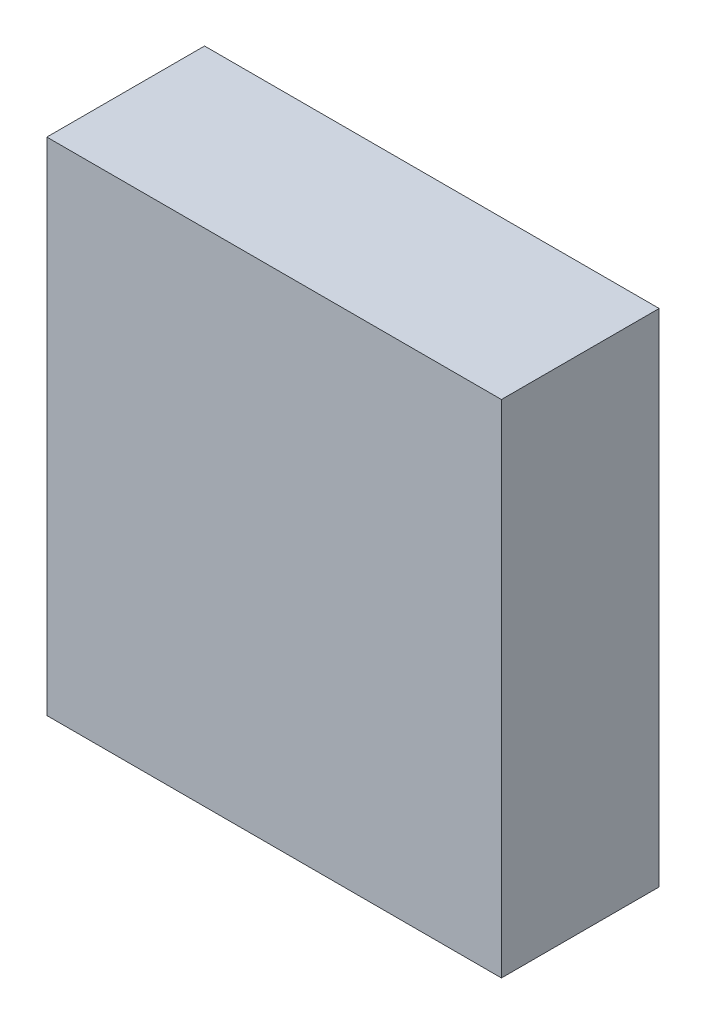
ISO-10303-21;
HEADER;
FILE_DESCRIPTION(('STEP AP214'),'2;1');
FILE_NAME('part.step','',(''),(''),'','','');
FILE_SCHEMA(('AUTOMOTIVE_DESIGN { 1 0 10303 214 1 1 1 1 }'));
ENDSEC;
DATA;
#1=APPLICATION_CONTEXT('core data for automotive mechanical design processes');
#2=APPLICATION_PROTOCOL_DEFINITION('international standard','automotive_design',2000,#1);
#3=PRODUCT_CONTEXT('',#1,'mechanical');
#4=PRODUCT('Part','Part','',(#3));
#5=PRODUCT_RELATED_PRODUCT_CATEGORY('part','',(#4));
#6=PRODUCT_DEFINITION_FORMATION('','',#4);
#7=PRODUCT_DEFINITION_CONTEXT('part definition',#1,'design');
#8=PRODUCT_DEFINITION('design','',#6,#7);
#9=PRODUCT_DEFINITION_SHAPE('','',#8);
#10=(LENGTH_UNIT() NAMED_UNIT(*) SI_UNIT(.MILLI.,.METRE.));
#11=(NAMED_UNIT(*) PLANE_ANGLE_UNIT() SI_UNIT($,.RADIAN.));
#12=(NAMED_UNIT(*) SI_UNIT($,.STERADIAN.) SOLID_ANGLE_UNIT());
#13=UNCERTAINTY_MEASURE_WITH_UNIT(LENGTH_MEASURE(1.E-05),#10,'distance_accuracy_value','');
#14=(GEOMETRIC_REPRESENTATION_CONTEXT(3) GLOBAL_UNCERTAINTY_ASSIGNED_CONTEXT((#13)) GLOBAL_UNIT_ASSIGNED_CONTEXT((#10,
#11,#12)) REPRESENTATION_CONTEXT('',''));
#15=CARTESIAN_POINT('',(0.,0.,0.));
#16=DIRECTION('',(0.,0.,1.));
#17=DIRECTION('',(1.,0.,0.));
#18=AXIS2_PLACEMENT_3D('',#15,#16,#17);
#19=CARTESIAN_POINT('',(-2.45000121332977,2.70001302060621,0.));
#20=DIRECTION('',(-1.,1.19248806385031E-08,0.));
#21=DIRECTION('',(-1.19248806385031E-08,-1.,0.));
#22=AXIS2_PLACEMENT_3D('',#19,#20,#21);
#23=PLANE('',#22);
#24=DIRECTION('',(-1.19248806627069E-08,-1.,0.));
#25=VECTOR('',#24,1.);
#26=CARTESIAN_POINT('',(-2.45000121332977,2.70001302060621,0.));
#27=LINE('',#26,#25);
#28=CARTESIAN_POINT('',(-2.45000121332977,2.70001302060621,0.));
#29=VERTEX_POINT('',#28);
#30=CARTESIAN_POINT('',(-2.45000127772406,-2.69998087587817,0.));
#31=VERTEX_POINT('',#30);
#32=EDGE_CURVE('E11',#29,#31,#27,.T.);
#33=ORIENTED_EDGE('',*,*,#32,.T.);
#34=DIRECTION('',(0.,0.,1.));
#35=VECTOR('',#34,1.);
#36=CARTESIAN_POINT('',(-2.45000127772405,-2.69998087587817,0.));
#37=LINE('',#36,#35);
#38=CARTESIAN_POINT('',(-2.45000127772406,-2.69998087587817,1.6999990940094));
#39=VERTEX_POINT('',#38);
#40=EDGE_CURVE('E88',#31,#39,#37,.T.);
#41=ORIENTED_EDGE('',*,*,#40,.T.);
#42=DIRECTION('',(-1.19248806627069E-08,-1.,0.));
#43=VECTOR('',#42,1.);
#44=CARTESIAN_POINT('',(-2.45000121332977,2.70001302060621,1.6999990940094));
#45=LINE('',#44,#43);
#46=CARTESIAN_POINT('',(-2.45000121332977,2.70001302060621,1.6999990940094));
#47=VERTEX_POINT('',#46);
#48=EDGE_CURVE('E83',#47,#39,#45,.T.);
#49=ORIENTED_EDGE('',*,*,#48,.F.);
#50=DIRECTION('',(0.,0.,1.));
#51=VECTOR('',#50,1.);
#52=CARTESIAN_POINT('',(-2.45000121332977,2.70001302060619,0.));
#53=LINE('',#52,#51);
#54=EDGE_CURVE('E72',#29,#47,#53,.T.);
#55=ORIENTED_EDGE('',*,*,#54,.F.);
#56=EDGE_LOOP('',(#33,#41,#49,#55));
#57=FACE_BOUND('',#56,.T.);
#58=ADVANCED_FACE('F17',(#57),#23,.T.);
#59=CARTESIAN_POINT('',(-2.45000127772406,-2.69998087587817,0.));
#60=DIRECTION('',(-1.19248806385031E-08,-1.,0.));
#61=DIRECTION('',(1.,-1.19248806385031E-08,0.));
#62=AXIS2_PLACEMENT_3D('',#59,#60,#61);
#63=PLANE('',#62);
#64=DIRECTION('',(1.,-1.1924880625848E-08,0.));
#65=VECTOR('',#64,1.);
#66=CARTESIAN_POINT('',(-2.45000127772406,-2.69998087587817,0.));
#67=LINE('',#66,#65);
#68=CARTESIAN_POINT('',(2.44999643345759,-2.69998093431008,0.));
#69=VERTEX_POINT('',#68);
#70=EDGE_CURVE('E24',#31,#69,#67,.T.);
#71=ORIENTED_EDGE('',*,*,#70,.T.);
#72=DIRECTION('',(0.,0.,1.));
#73=VECTOR('',#72,1.);
#74=CARTESIAN_POINT('',(2.44999643345758,-2.69998093431006,0.));
#75=LINE('',#74,#73);
#76=CARTESIAN_POINT('',(2.44999643345759,-2.69998093431008,1.6999990940094));
#77=VERTEX_POINT('',#76);
#78=EDGE_CURVE('E85',#69,#77,#75,.T.);
#79=ORIENTED_EDGE('',*,*,#78,.T.);
#80=DIRECTION('',(1.,-1.1924880625848E-08,0.));
#81=VECTOR('',#80,1.);
#82=CARTESIAN_POINT('',(-2.45000127772406,-2.69998087587817,1.6999990940094));
#83=LINE('',#82,#81);
#84=EDGE_CURVE('E66',#39,#77,#83,.T.);
#85=ORIENTED_EDGE('',*,*,#84,.F.);
#86=ORIENTED_EDGE('',*,*,#40,.F.);
#87=EDGE_LOOP('',(#71,#79,#85,#86));
#88=FACE_BOUND('',#87,.T.);
#89=ADVANCED_FACE('F89',(#88),#63,.T.);
#90=CARTESIAN_POINT('',(2.44999643345759,-2.69998093431008,0.));
#91=DIRECTION('',(1.,-1.19248806385031E-08,0.));
#92=DIRECTION('',(1.19248806385031E-08,1.,0.));
#93=AXIS2_PLACEMENT_3D('',#90,#91,#92);
#94=PLANE('',#93);
#95=DIRECTION('',(1.19248806627069E-08,1.,0.));
#96=VECTOR('',#95,1.);
#97=CARTESIAN_POINT('',(2.44999643345759,-2.69998093431008,0.));
#98=LINE('',#97,#96);
#99=CARTESIAN_POINT('',(2.44999649785187,2.7000129621743,0.));
#100=VERTEX_POINT('',#99);
#101=EDGE_CURVE('E62',#69,#100,#98,.T.);
#102=ORIENTED_EDGE('',*,*,#101,.T.);
#103=DIRECTION('',(0.,0.,1.));
#104=VECTOR('',#103,1.);
#105=CARTESIAN_POINT('',(2.44999649785188,2.7000129621743,0.));
#106=LINE('',#105,#104);
#107=CARTESIAN_POINT('',(2.44999649785187,2.7000129621743,1.6999990940094));
#108=VERTEX_POINT('',#107);
#109=EDGE_CURVE('E55',#100,#108,#106,.T.);
#110=ORIENTED_EDGE('',*,*,#109,.T.);
#111=DIRECTION('',(1.19248806627069E-08,1.,0.));
#112=VECTOR('',#111,1.);
#113=CARTESIAN_POINT('',(2.44999643345759,-2.69998093431008,1.6999990940094));
#114=LINE('',#113,#112);
#115=EDGE_CURVE('E59',#77,#108,#114,.T.);
#116=ORIENTED_EDGE('',*,*,#115,.F.);
#117=ORIENTED_EDGE('',*,*,#78,.F.);
#118=EDGE_LOOP('',(#102,#110,#116,#117));
#119=FACE_BOUND('',#118,.T.);
#120=ADVANCED_FACE('F57',(#119),#94,.T.);
#121=CARTESIAN_POINT('',(2.44999649785187,2.7000129621743,0.));
#122=DIRECTION('',(1.19248806385031E-08,1.,0.));
#123=DIRECTION('',(-1.,1.19248806385031E-08,0.));
#124=AXIS2_PLACEMENT_3D('',#121,#122,#123);
#125=PLANE('',#124);
#126=DIRECTION('',(-1.,1.1924880625848E-08,0.));
#127=VECTOR('',#126,1.);
#128=CARTESIAN_POINT('',(2.44999649785187,2.7000129621743,0.));
#129=LINE('',#128,#127);
#130=EDGE_CURVE('E65',#100,#29,#129,.T.);
#131=ORIENTED_EDGE('',*,*,#130,.T.);
#132=ORIENTED_EDGE('',*,*,#54,.T.);
#133=DIRECTION('',(-1.,1.1924880625848E-08,0.));
#134=VECTOR('',#133,1.);
#135=CARTESIAN_POINT('',(2.44999649785187,2.7000129621743,1.6999990940094));
#136=LINE('',#135,#134);
#137=EDGE_CURVE('E70',#108,#47,#136,.T.);
#138=ORIENTED_EDGE('',*,*,#137,.F.);
#139=ORIENTED_EDGE('',*,*,#109,.F.);
#140=EDGE_LOOP('',(#131,#132,#138,#139));
#141=FACE_BOUND('',#140,.T.);
#142=ADVANCED_FACE('F71',(#141),#125,.T.);
#143=CARTESIAN_POINT('',(65.7749938964844,-279.424987792969,1.6999990940094));
#144=DIRECTION('',(0.,0.,1.));
#145=DIRECTION('',(1.19248806385031E-08,1.,0.));
#146=AXIS2_PLACEMENT_3D('',#143,#144,#145);
#147=PLANE('',#146);
#148=ORIENTED_EDGE('',*,*,#48,.T.);
#149=ORIENTED_EDGE('',*,*,#84,.T.);
#150=ORIENTED_EDGE('',*,*,#115,.T.);
#151=ORIENTED_EDGE('',*,*,#137,.T.);
#152=EDGE_LOOP('',(#148,#149,#150,#151));
#153=FACE_BOUND('',#152,.T.);
#154=ADVANCED_FACE('F76',(#153),#147,.T.);
#155=CARTESIAN_POINT('',(65.7749938964844,-279.424987792969,0.));
#156=DIRECTION('',(0.,0.,1.));
#157=DIRECTION('',(1.19248806385031E-08,1.,0.));
#158=AXIS2_PLACEMENT_3D('',#155,#156,#157);
#159=PLANE('',#158);
#160=ORIENTED_EDGE('',*,*,#130,.F.);
#161=ORIENTED_EDGE('',*,*,#101,.F.);
#162=ORIENTED_EDGE('',*,*,#70,.F.);
#163=ORIENTED_EDGE('',*,*,#32,.F.);
#164=EDGE_LOOP('',(#160,#161,#162,#163));
#165=FACE_BOUND('',#164,.T.);
#166=ADVANCED_FACE('F91',(#165),#159,.F.);
#167=CLOSED_SHELL('',(#58,#89,#120,#142,#154,#166));
#168=MANIFOLD_SOLID_BREP('B1',#167);
#169=ADVANCED_BREP_SHAPE_REPRESENTATION('',(#18,#168),#14);
#170=SHAPE_DEFINITION_REPRESENTATION(#9,#169);
ENDSEC;
END-ISO-10303-21;
